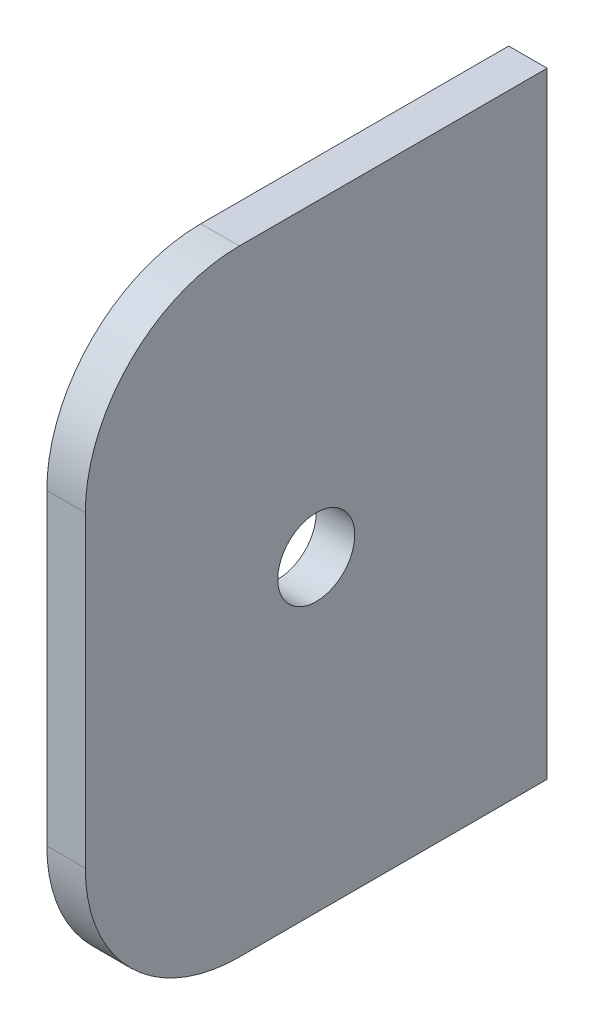
ISO-10303-21;
HEADER;
FILE_DESCRIPTION(('STEP AP214'),'2;1');
FILE_NAME('part.step','',(''),(''),'','','');
FILE_SCHEMA(('AUTOMOTIVE_DESIGN { 1 0 10303 214 1 1 1 1 }'));
ENDSEC;
DATA;
#1=APPLICATION_CONTEXT('core data for automotive mechanical design processes');
#2=APPLICATION_PROTOCOL_DEFINITION('international standard','automotive_design',2000,#1);
#3=PRODUCT_CONTEXT('',#1,'mechanical');
#4=PRODUCT('Part','Part','',(#3));
#5=PRODUCT_RELATED_PRODUCT_CATEGORY('part','',(#4));
#6=PRODUCT_DEFINITION_FORMATION('','',#4);
#7=PRODUCT_DEFINITION_CONTEXT('part definition',#1,'design');
#8=PRODUCT_DEFINITION('design','',#6,#7);
#9=PRODUCT_DEFINITION_SHAPE('','',#8);
#10=(LENGTH_UNIT() NAMED_UNIT(*) SI_UNIT(.MILLI.,.METRE.));
#11=(NAMED_UNIT(*) PLANE_ANGLE_UNIT() SI_UNIT($,.RADIAN.));
#12=(NAMED_UNIT(*) SI_UNIT($,.STERADIAN.) SOLID_ANGLE_UNIT());
#13=UNCERTAINTY_MEASURE_WITH_UNIT(LENGTH_MEASURE(1.E-05),#10,'distance_accuracy_value','');
#14=(GEOMETRIC_REPRESENTATION_CONTEXT(3) GLOBAL_UNCERTAINTY_ASSIGNED_CONTEXT((#13)) GLOBAL_UNIT_ASSIGNED_CONTEXT((#10,
#11,#12)) REPRESENTATION_CONTEXT('',''));
#15=CARTESIAN_POINT('',(0.,0.,0.));
#16=DIRECTION('',(0.,0.,1.));
#17=DIRECTION('',(1.,0.,0.));
#18=AXIS2_PLACEMENT_3D('',#15,#16,#17);
#19=CARTESIAN_POINT('',(19.05,1.016,38.1));
#20=DIRECTION('',(0.,-1.,0.));
#21=DIRECTION('',(1.,0.,0.));
#22=AXIS2_PLACEMENT_3D('',#19,#20,#21);
#23=PLANE('',#22);
#24=DIRECTION('',(0.,0.,-1.));
#25=VECTOR('',#24,1.);
#26=CARTESIAN_POINT('',(15.875,1.016,38.1));
#27=LINE('',#26,#25);
#28=CARTESIAN_POINT('',(15.875,1.016,25.4));
#29=VERTEX_POINT('',#28);
#30=CARTESIAN_POINT('',(15.875,1.016,0.));
#31=VERTEX_POINT('',#30);
#32=EDGE_CURVE('E89',#29,#31,#27,.T.);
#33=ORIENTED_EDGE('',*,*,#32,.F.);
#34=DIRECTION('',(-1.,0.,0.));
#35=VECTOR('',#34,1.);
#36=CARTESIAN_POINT('',(19.05,1.016,25.4));
#37=LINE('',#36,#35);
#38=CARTESIAN_POINT('',(19.05,1.016,25.4));
#39=VERTEX_POINT('',#38);
#40=EDGE_CURVE('E58',#29,#39,#37,.F.);
#41=ORIENTED_EDGE('',*,*,#40,.T.);
#42=DIRECTION('',(0.,0.,-1.));
#43=VECTOR('',#42,1.);
#44=CARTESIAN_POINT('',(19.05,1.016,38.1));
#45=LINE('',#44,#43);
#46=CARTESIAN_POINT('',(19.05,1.016,0.));
#47=VERTEX_POINT('',#46);
#48=EDGE_CURVE('E110',#39,#47,#45,.T.);
#49=ORIENTED_EDGE('',*,*,#48,.T.);
#50=DIRECTION('',(-1.,0.,0.));
#51=VECTOR('',#50,1.);
#52=CARTESIAN_POINT('',(19.05,1.016,0.));
#53=LINE('',#52,#51);
#54=EDGE_CURVE('E105',#47,#31,#53,.T.);
#55=ORIENTED_EDGE('',*,*,#54,.T.);
#56=EDGE_LOOP('',(#33,#41,#49,#55));
#57=FACE_BOUND('',#56,.T.);
#58=ADVANCED_FACE('F35',(#57),#23,.F.);
#59=CARTESIAN_POINT('',(15.875,1.016,38.1));
#60=DIRECTION('',(1.,0.,0.));
#61=DIRECTION('',(0.,1.,0.));
#62=AXIS2_PLACEMENT_3D('',#59,#60,#61);
#63=PLANE('',#62);
#64=CARTESIAN_POINT('',(15.875,-24.384,19.05));
#65=DIRECTION('',(-1.,0.,0.));
#66=DIRECTION('',(0.,-1.,0.));
#67=AXIS2_PLACEMENT_3D('',#64,#65,#66);
#68=CIRCLE('',#67,3.175);
#69=CARTESIAN_POINT('',(15.875,-27.559,19.05));
#70=VERTEX_POINT('',#69);
#71=EDGE_CURVE('E114',#70,#70,#68,.T.);
#72=ORIENTED_EDGE('',*,*,#71,.F.);
#73=EDGE_LOOP('',(#72));
#74=FACE_BOUND('',#73,.T.);
#75=DIRECTION('',(0.,-1.,0.));
#76=VECTOR('',#75,1.);
#77=CARTESIAN_POINT('',(15.875,1.016,38.1));
#78=LINE('',#77,#76);
#79=CARTESIAN_POINT('',(15.875,-11.684,38.1));
#80=VERTEX_POINT('',#79);
#81=CARTESIAN_POINT('',(15.875,-37.084,38.1));
#82=VERTEX_POINT('',#81);
#83=EDGE_CURVE('E123',#80,#82,#78,.T.);
#84=ORIENTED_EDGE('',*,*,#83,.F.);
#85=CARTESIAN_POINT('',(15.875,-11.684,25.4));
#86=DIRECTION('',(1.,0.,0.));
#87=DIRECTION('',(0.,1.,0.));
#88=AXIS2_PLACEMENT_3D('',#85,#86,#87);
#89=CIRCLE('',#88,12.7);
#90=EDGE_CURVE('E96',#80,#29,#89,.F.);
#91=ORIENTED_EDGE('',*,*,#90,.T.);
#92=ORIENTED_EDGE('',*,*,#32,.T.);
#93=DIRECTION('',(0.,-1.,0.));
#94=VECTOR('',#93,1.);
#95=CARTESIAN_POINT('',(15.875,1.016,0.));
#96=LINE('',#95,#94);
#97=CARTESIAN_POINT('',(15.875,-49.784,0.));
#98=VERTEX_POINT('',#97);
#99=EDGE_CURVE('E94',#31,#98,#96,.T.);
#100=ORIENTED_EDGE('',*,*,#99,.T.);
#101=DIRECTION('',(0.,0.,-1.));
#102=VECTOR('',#101,1.);
#103=CARTESIAN_POINT('',(15.875,-49.784,38.1));
#104=LINE('',#103,#102);
#105=CARTESIAN_POINT('',(15.875,-49.784,25.4));
#106=VERTEX_POINT('',#105);
#107=EDGE_CURVE('E99',#106,#98,#104,.T.);
#108=ORIENTED_EDGE('',*,*,#107,.F.);
#109=CARTESIAN_POINT('',(15.875,-37.084,25.4));
#110=DIRECTION('',(1.,0.,0.));
#111=DIRECTION('',(0.,1.,0.));
#112=AXIS2_PLACEMENT_3D('',#109,#110,#111);
#113=CIRCLE('',#112,12.7);
#114=EDGE_CURVE('E132',#106,#82,#113,.F.);
#115=ORIENTED_EDGE('',*,*,#114,.T.);
#116=EDGE_LOOP('',(#84,#91,#92,#100,#108,#115));
#117=FACE_BOUND('',#116,.T.);
#118=ADVANCED_FACE('F92',(#74,#117),#63,.F.);
#119=CARTESIAN_POINT('',(19.05,-49.784,38.1));
#120=DIRECTION('',(0.,-1.,0.));
#121=DIRECTION('',(0.,0.,-1.));
#122=AXIS2_PLACEMENT_3D('',#119,#120,#121);
#123=PLANE('',#122);
#124=DIRECTION('',(0.,0.,-1.));
#125=VECTOR('',#124,1.);
#126=CARTESIAN_POINT('',(19.05,-49.784,38.1));
#127=LINE('',#126,#125);
#128=CARTESIAN_POINT('',(19.05,-49.784,25.4));
#129=VERTEX_POINT('',#128);
#130=CARTESIAN_POINT('',(19.05,-49.784,0.));
#131=VERTEX_POINT('',#130);
#132=EDGE_CURVE('E125',#129,#131,#127,.T.);
#133=ORIENTED_EDGE('',*,*,#132,.F.);
#134=DIRECTION('',(-1.,0.,0.));
#135=VECTOR('',#134,1.);
#136=CARTESIAN_POINT('',(19.05,-49.784,25.4));
#137=LINE('',#136,#135);
#138=EDGE_CURVE('E11',#129,#106,#137,.T.);
#139=ORIENTED_EDGE('',*,*,#138,.T.);
#140=ORIENTED_EDGE('',*,*,#107,.T.);
#141=DIRECTION('',(-1.,0.,0.));
#142=VECTOR('',#141,1.);
#143=CARTESIAN_POINT('',(19.05,-49.784,0.));
#144=LINE('',#143,#142);
#145=EDGE_CURVE('E108',#131,#98,#144,.T.);
#146=ORIENTED_EDGE('',*,*,#145,.F.);
#147=EDGE_LOOP('',(#133,#139,#140,#146));
#148=FACE_BOUND('',#147,.T.);
#149=ADVANCED_FACE('F160',(#148),#123,.T.);
#150=CARTESIAN_POINT('',(19.05,1.016,38.1));
#151=DIRECTION('',(1.,0.,0.));
#152=DIRECTION('',(0.,0.,-1.));
#153=AXIS2_PLACEMENT_3D('',#150,#151,#152);
#154=PLANE('',#153);
#155=CARTESIAN_POINT('',(19.05,-24.384,19.05));
#156=DIRECTION('',(1.,0.,0.));
#157=DIRECTION('',(0.,0.,-1.));
#158=AXIS2_PLACEMENT_3D('',#155,#156,#157);
#159=CIRCLE('',#158,3.175);
#160=CARTESIAN_POINT('',(19.05,-24.384,15.875));
#161=VERTEX_POINT('',#160);
#162=EDGE_CURVE('E111',#161,#161,#159,.T.);
#163=ORIENTED_EDGE('',*,*,#162,.F.);
#164=EDGE_LOOP('',(#163));
#165=FACE_BOUND('',#164,.T.);
#166=ORIENTED_EDGE('',*,*,#48,.F.);
#167=CARTESIAN_POINT('',(19.05,-11.684,25.4));
#168=DIRECTION('',(1.,0.,0.));
#169=DIRECTION('',(0.,0.,-1.));
#170=AXIS2_PLACEMENT_3D('',#167,#168,#169);
#171=CIRCLE('',#170,12.7);
#172=CARTESIAN_POINT('',(19.05,-11.684,38.1));
#173=VERTEX_POINT('',#172);
#174=EDGE_CURVE('E43',#39,#173,#171,.T.);
#175=ORIENTED_EDGE('',*,*,#174,.T.);
#176=DIRECTION('',(0.,-1.,0.));
#177=VECTOR('',#176,1.);
#178=CARTESIAN_POINT('',(19.05,1.016,38.1));
#179=LINE('',#178,#177);
#180=CARTESIAN_POINT('',(19.05,-37.084,38.1));
#181=VERTEX_POINT('',#180);
#182=EDGE_CURVE('E117',#173,#181,#179,.T.);
#183=ORIENTED_EDGE('',*,*,#182,.T.);
#184=CARTESIAN_POINT('',(19.05,-37.084,25.4));
#185=DIRECTION('',(1.,0.,0.));
#186=DIRECTION('',(0.,0.,-1.));
#187=AXIS2_PLACEMENT_3D('',#184,#185,#186);
#188=CIRCLE('',#187,12.7);
#189=EDGE_CURVE('E50',#181,#129,#188,.T.);
#190=ORIENTED_EDGE('',*,*,#189,.T.);
#191=ORIENTED_EDGE('',*,*,#132,.T.);
#192=DIRECTION('',(0.,-1.,0.));
#193=VECTOR('',#192,1.);
#194=CARTESIAN_POINT('',(19.05,1.016,0.));
#195=LINE('',#194,#193);
#196=EDGE_CURVE('E121',#47,#131,#195,.T.);
#197=ORIENTED_EDGE('',*,*,#196,.F.);
#198=EDGE_LOOP('',(#166,#175,#183,#190,#191,#197));
#199=FACE_BOUND('',#198,.T.);
#200=ADVANCED_FACE('F138',(#165,#199),#154,.T.);
#201=CARTESIAN_POINT('',(0.,0.,38.1));
#202=DIRECTION('',(0.,0.,1.));
#203=DIRECTION('',(1.,0.,0.));
#204=AXIS2_PLACEMENT_3D('',#201,#202,#203);
#205=PLANE('',#204);
#206=ORIENTED_EDGE('',*,*,#182,.F.);
#207=DIRECTION('',(-1.,0.,0.));
#208=VECTOR('',#207,1.);
#209=CARTESIAN_POINT('',(15.875,-11.684,38.1));
#210=LINE('',#209,#208);
#211=EDGE_CURVE('E129',#173,#80,#210,.T.);
#212=ORIENTED_EDGE('',*,*,#211,.T.);
#213=ORIENTED_EDGE('',*,*,#83,.T.);
#214=DIRECTION('',(-1.,0.,0.));
#215=VECTOR('',#214,1.);
#216=CARTESIAN_POINT('',(0.,-37.084,38.1));
#217=LINE('',#216,#215);
#218=EDGE_CURVE('E98',#82,#181,#217,.F.);
#219=ORIENTED_EDGE('',*,*,#218,.T.);
#220=EDGE_LOOP('',(#206,#212,#213,#219));
#221=FACE_BOUND('',#220,.T.);
#222=ADVANCED_FACE('F142',(#221),#205,.T.);
#223=CARTESIAN_POINT('',(0.,0.,0.));
#224=DIRECTION('',(0.,0.,1.));
#225=DIRECTION('',(1.,0.,0.));
#226=AXIS2_PLACEMENT_3D('',#223,#224,#225);
#227=PLANE('',#226);
#228=ORIENTED_EDGE('',*,*,#54,.F.);
#229=ORIENTED_EDGE('',*,*,#196,.T.);
#230=ORIENTED_EDGE('',*,*,#145,.T.);
#231=ORIENTED_EDGE('',*,*,#99,.F.);
#232=EDGE_LOOP('',(#228,#229,#230,#231));
#233=FACE_BOUND('',#232,.T.);
#234=ADVANCED_FACE('F103',(#233),#227,.F.);
#235=CARTESIAN_POINT('',(53.975,-24.384,19.05));
#236=DIRECTION('',(-1.,0.,0.));
#237=DIRECTION('',(0.,-1.,0.));
#238=AXIS2_PLACEMENT_3D('',#235,#236,#237);
#239=CYLINDRICAL_SURFACE('',#238,3.175);
#240=ORIENTED_EDGE('',*,*,#162,.T.);
#241=EDGE_LOOP('',(#240));
#242=FACE_BOUND('',#241,.T.);
#243=ORIENTED_EDGE('',*,*,#71,.T.);
#244=EDGE_LOOP('',(#243));
#245=FACE_BOUND('',#244,.T.);
#246=ADVANCED_FACE('F147',(#242,#245),#239,.F.);
#247=CARTESIAN_POINT('',(0.,-11.684,25.4));
#248=DIRECTION('',(1.,0.,0.));
#249=DIRECTION('',(0.,1.,0.));
#250=AXIS2_PLACEMENT_3D('',#247,#248,#249);
#251=CYLINDRICAL_SURFACE('',#250,12.7);
#252=ORIENTED_EDGE('',*,*,#174,.F.);
#253=ORIENTED_EDGE('',*,*,#40,.F.);
#254=ORIENTED_EDGE('',*,*,#90,.F.);
#255=ORIENTED_EDGE('',*,*,#211,.F.);
#256=EDGE_LOOP('',(#252,#253,#254,#255));
#257=FACE_BOUND('',#256,.T.);
#258=ADVANCED_FACE('F145',(#257),#251,.T.);
#259=CARTESIAN_POINT('',(19.05,-37.084,25.4));
#260=DIRECTION('',(-1.,0.,0.));
#261=DIRECTION('',(0.,0.,1.));
#262=AXIS2_PLACEMENT_3D('',#259,#260,#261);
#263=CYLINDRICAL_SURFACE('',#262,12.7);
#264=ORIENTED_EDGE('',*,*,#189,.F.);
#265=ORIENTED_EDGE('',*,*,#218,.F.);
#266=ORIENTED_EDGE('',*,*,#114,.F.);
#267=ORIENTED_EDGE('',*,*,#138,.F.);
#268=EDGE_LOOP('',(#264,#265,#266,#267));
#269=FACE_BOUND('',#268,.T.);
#270=ADVANCED_FACE('F37',(#269),#263,.T.);
#271=CLOSED_SHELL('',(#58,#118,#149,#200,#222,#234,#246,#258,#270));
#272=MANIFOLD_SOLID_BREP('B2',#271);
#273=ADVANCED_BREP_SHAPE_REPRESENTATION('',(#18,#272),#14);
#274=SHAPE_DEFINITION_REPRESENTATION(#9,#273);
ENDSEC;
END-ISO-10303-21;
